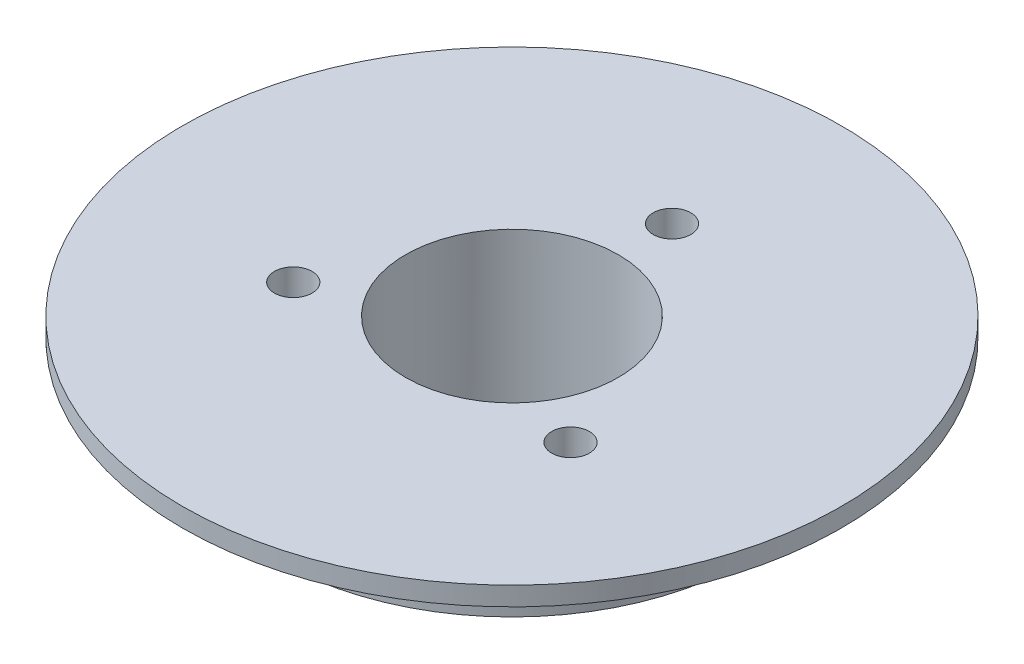
ISO-10303-21;
HEADER;
FILE_DESCRIPTION(('STEP AP214'),'2;1');
FILE_NAME('part.step','',(''),(''),'','','');
FILE_SCHEMA(('AUTOMOTIVE_DESIGN { 1 0 10303 214 1 1 1 1 }'));
ENDSEC;
DATA;
#1=APPLICATION_CONTEXT('core data for automotive mechanical design processes');
#2=APPLICATION_PROTOCOL_DEFINITION('international standard','automotive_design',2000,#1);
#3=PRODUCT_CONTEXT('',#1,'mechanical');
#4=PRODUCT('Part','Part','',(#3));
#5=PRODUCT_RELATED_PRODUCT_CATEGORY('part','',(#4));
#6=PRODUCT_DEFINITION_FORMATION('','',#4);
#7=PRODUCT_DEFINITION_CONTEXT('part definition',#1,'design');
#8=PRODUCT_DEFINITION('design','',#6,#7);
#9=PRODUCT_DEFINITION_SHAPE('','',#8);
#10=(LENGTH_UNIT() NAMED_UNIT(*) SI_UNIT(.MILLI.,.METRE.));
#11=(NAMED_UNIT(*) PLANE_ANGLE_UNIT() SI_UNIT($,.RADIAN.));
#12=(NAMED_UNIT(*) SI_UNIT($,.STERADIAN.) SOLID_ANGLE_UNIT());
#13=UNCERTAINTY_MEASURE_WITH_UNIT(LENGTH_MEASURE(1.E-05),#10,'distance_accuracy_value','');
#14=(GEOMETRIC_REPRESENTATION_CONTEXT(3) GLOBAL_UNCERTAINTY_ASSIGNED_CONTEXT((#13)) GLOBAL_UNIT_ASSIGNED_CONTEXT((#10,
#11,#12)) REPRESENTATION_CONTEXT('',''));
#15=CARTESIAN_POINT('',(0.,0.,0.));
#16=DIRECTION('',(0.,0.,1.));
#17=DIRECTION('',(1.,0.,0.));
#18=AXIS2_PLACEMENT_3D('',#15,#16,#17);
#19=CARTESIAN_POINT('',(0.,0.,0.));
#20=DIRECTION('',(0.,1.,0.));
#21=DIRECTION('',(0.,0.,1.));
#22=AXIS2_PLACEMENT_3D('',#19,#20,#21);
#23=PLANE('',#22);
#24=CARTESIAN_POINT('',(0.,0.,20.));
#25=DIRECTION('',(0.,-1.,0.));
#26=DIRECTION('',(0.,0.,-1.));
#27=AXIS2_PLACEMENT_3D('',#24,#25,#26);
#28=CIRCLE('',#27,2.);
#29=CARTESIAN_POINT('',(0.,0.,18.));
#30=VERTEX_POINT('',#29);
#31=EDGE_CURVE('E113',#30,#30,#28,.T.);
#32=ORIENTED_EDGE('',*,*,#31,.F.);
#33=EDGE_LOOP('',(#32));
#34=FACE_BOUND('',#33,.T.);
#35=CARTESIAN_POINT('',(17.3205080756901,0.,-9.99999999999926));
#36=DIRECTION('',(0.,-1.,0.));
#37=DIRECTION('',(0.,0.,-1.));
#38=AXIS2_PLACEMENT_3D('',#35,#36,#37);
#39=CIRCLE('',#38,2.0000000000011);
#40=CARTESIAN_POINT('',(17.3205080756901,0.,-12.0000000000004));
#41=VERTEX_POINT('',#40);
#42=EDGE_CURVE('E107',#41,#41,#39,.T.);
#43=ORIENTED_EDGE('',*,*,#42,.F.);
#44=EDGE_LOOP('',(#43));
#45=FACE_BOUND('',#44,.T.);
#46=CARTESIAN_POINT('',(-17.3205080756875,0.,-10.0000000000007));
#47=DIRECTION('',(0.,-1.,0.));
#48=DIRECTION('',(0.,0.,-1.));
#49=AXIS2_PLACEMENT_3D('',#46,#47,#48);
#50=CIRCLE('',#49,2.00000000000161);
#51=CARTESIAN_POINT('',(-17.3205080756875,0.,-12.0000000000024));
#52=VERTEX_POINT('',#51);
#53=EDGE_CURVE('E101',#52,#52,#50,.T.);
#54=ORIENTED_EDGE('',*,*,#53,.F.);
#55=EDGE_LOOP('',(#54));
#56=FACE_BOUND('',#55,.T.);
#57=CARTESIAN_POINT('',(0.,0.,0.));
#58=DIRECTION('',(0.,1.,0.));
#59=DIRECTION('',(0.,0.,1.));
#60=AXIS2_PLACEMENT_3D('',#57,#58,#59);
#61=CIRCLE('',#60,25.);
#62=CARTESIAN_POINT('',(0.,0.,25.));
#63=VERTEX_POINT('',#62);
#64=EDGE_CURVE('E89',#63,#63,#61,.T.);
#65=ORIENTED_EDGE('',*,*,#64,.F.);
#66=EDGE_LOOP('',(#65));
#67=FACE_BOUND('',#66,.T.);
#68=CARTESIAN_POINT('',(0.,0.,0.));
#69=DIRECTION('',(0.,1.,0.));
#70=DIRECTION('',(0.,0.,1.));
#71=AXIS2_PLACEMENT_3D('',#68,#69,#70);
#72=CIRCLE('',#71,12.5);
#73=CARTESIAN_POINT('',(0.,0.,12.5));
#74=VERTEX_POINT('',#73);
#75=EDGE_CURVE('E46',#74,#74,#72,.F.);
#76=ORIENTED_EDGE('',*,*,#75,.F.);
#77=EDGE_LOOP('',(#76));
#78=FACE_BOUND('',#77,.T.);
#79=ADVANCED_FACE('F35',(#34,#45,#56,#67,#78),#23,.F.);
#80=CARTESIAN_POINT('',(0.,10.,0.));
#81=DIRECTION('',(0.,1.,0.));
#82=DIRECTION('',(0.,0.,1.));
#83=AXIS2_PLACEMENT_3D('',#80,#81,#82);
#84=PLANE('',#83);
#85=CARTESIAN_POINT('',(-14.7224318643354,10.,8.50000000000007));
#86=DIRECTION('',(0.,1.,0.));
#87=DIRECTION('',(0.,0.,1.));
#88=AXIS2_PLACEMENT_3D('',#85,#86,#87);
#89=CIRCLE('',#88,2.);
#90=CARTESIAN_POINT('',(-14.7224318643354,10.,10.5000000000001));
#91=VERTEX_POINT('',#90);
#92=EDGE_CURVE('E64',#91,#91,#89,.F.);
#93=ORIENTED_EDGE('',*,*,#92,.T.);
#94=EDGE_LOOP('',(#93));
#95=FACE_BOUND('',#94,.T.);
#96=CARTESIAN_POINT('',(0.,10.,-17.));
#97=DIRECTION('',(0.,1.,0.));
#98=DIRECTION('',(0.,0.,1.));
#99=AXIS2_PLACEMENT_3D('',#96,#97,#98);
#100=CIRCLE('',#99,2.);
#101=CARTESIAN_POINT('',(0.,10.,-15.));
#102=VERTEX_POINT('',#101);
#103=EDGE_CURVE('E58',#102,#102,#100,.F.);
#104=ORIENTED_EDGE('',*,*,#103,.T.);
#105=EDGE_LOOP('',(#104));
#106=FACE_BOUND('',#105,.T.);
#107=CARTESIAN_POINT('',(14.7224318643354,10.,8.50000000000007));
#108=DIRECTION('',(0.,1.,0.));
#109=DIRECTION('',(0.,0.,1.));
#110=AXIS2_PLACEMENT_3D('',#107,#108,#109);
#111=CIRCLE('',#110,2.);
#112=CARTESIAN_POINT('',(14.7224318643354,10.,10.5000000000001));
#113=VERTEX_POINT('',#112);
#114=EDGE_CURVE('E61',#113,#113,#111,.F.);
#115=ORIENTED_EDGE('',*,*,#114,.T.);
#116=EDGE_LOOP('',(#115));
#117=FACE_BOUND('',#116,.T.);
#118=CARTESIAN_POINT('',(0.,10.,0.));
#119=DIRECTION('',(0.,1.,0.));
#120=DIRECTION('',(0.,0.,1.));
#121=AXIS2_PLACEMENT_3D('',#118,#119,#120);
#122=CIRCLE('',#121,11.3);
#123=CARTESIAN_POINT('',(0.,10.,11.3));
#124=VERTEX_POINT('',#123);
#125=EDGE_CURVE('E67',#124,#124,#122,.T.);
#126=ORIENTED_EDGE('',*,*,#125,.F.);
#127=EDGE_LOOP('',(#126));
#128=FACE_BOUND('',#127,.T.);
#129=CARTESIAN_POINT('',(0.,10.,0.));
#130=DIRECTION('',(0.,1.,0.));
#131=DIRECTION('',(0.,0.,1.));
#132=AXIS2_PLACEMENT_3D('',#129,#130,#131);
#133=CIRCLE('',#132,35.);
#134=CARTESIAN_POINT('',(0.,10.,35.));
#135=VERTEX_POINT('',#134);
#136=EDGE_CURVE('E86',#135,#135,#133,.T.);
#137=ORIENTED_EDGE('',*,*,#136,.T.);
#138=EDGE_LOOP('',(#137));
#139=FACE_BOUND('',#138,.T.);
#140=ADVANCED_FACE('F130',(#95,#106,#117,#128,#139),#84,.T.);
#141=CARTESIAN_POINT('',(0.,2.,-17.));
#142=DIRECTION('',(0.,1.,0.));
#143=DIRECTION('',(0.,0.,1.));
#144=AXIS2_PLACEMENT_3D('',#141,#142,#143);
#145=PLANE('',#144);
#146=CARTESIAN_POINT('',(0.,2.,-17.));
#147=DIRECTION('',(0.,1.,0.));
#148=DIRECTION('',(0.,0.,1.));
#149=AXIS2_PLACEMENT_3D('',#146,#147,#148);
#150=CIRCLE('',#149,2.);
#151=CARTESIAN_POINT('',(0.,2.,-15.));
#152=VERTEX_POINT('',#151);
#153=EDGE_CURVE('E71',#152,#152,#150,.T.);
#154=ORIENTED_EDGE('',*,*,#153,.T.);
#155=EDGE_LOOP('',(#154));
#156=FACE_BOUND('',#155,.T.);
#157=ADVANCED_FACE('F132',(#156),#145,.T.);
#158=CARTESIAN_POINT('',(0.,2.,-17.));
#159=DIRECTION('',(0.,1.,0.));
#160=DIRECTION('',(0.,0.,1.));
#161=AXIS2_PLACEMENT_3D('',#158,#159,#160);
#162=CYLINDRICAL_SURFACE('',#161,2.);
#163=ORIENTED_EDGE('',*,*,#153,.F.);
#164=EDGE_LOOP('',(#163));
#165=FACE_BOUND('',#164,.T.);
#166=ORIENTED_EDGE('',*,*,#103,.F.);
#167=EDGE_LOOP('',(#166));
#168=FACE_BOUND('',#167,.T.);
#169=ADVANCED_FACE('F189',(#165,#168),#162,.F.);
#170=CARTESIAN_POINT('',(14.7224318643354,2.,8.50000000000007));
#171=DIRECTION('',(0.,1.,0.));
#172=DIRECTION('',(0.,0.,1.));
#173=AXIS2_PLACEMENT_3D('',#170,#171,#172);
#174=PLANE('',#173);
#175=CARTESIAN_POINT('',(14.7224318643354,2.,8.50000000000007));
#176=DIRECTION('',(0.,1.,0.));
#177=DIRECTION('',(0.,0.,1.));
#178=AXIS2_PLACEMENT_3D('',#175,#176,#177);
#179=CIRCLE('',#178,2.);
#180=CARTESIAN_POINT('',(14.7224318643354,2.,10.5000000000001));
#181=VERTEX_POINT('',#180);
#182=EDGE_CURVE('E74',#181,#181,#179,.T.);
#183=ORIENTED_EDGE('',*,*,#182,.T.);
#184=EDGE_LOOP('',(#183));
#185=FACE_BOUND('',#184,.T.);
#186=ADVANCED_FACE('F186',(#185),#174,.T.);
#187=CARTESIAN_POINT('',(14.7224318643354,2.,8.50000000000007));
#188=DIRECTION('',(0.,1.,0.));
#189=DIRECTION('',(0.,0.,1.));
#190=AXIS2_PLACEMENT_3D('',#187,#188,#189);
#191=CYLINDRICAL_SURFACE('',#190,2.);
#192=ORIENTED_EDGE('',*,*,#182,.F.);
#193=EDGE_LOOP('',(#192));
#194=FACE_BOUND('',#193,.T.);
#195=ORIENTED_EDGE('',*,*,#114,.F.);
#196=EDGE_LOOP('',(#195));
#197=FACE_BOUND('',#196,.T.);
#198=ADVANCED_FACE('F184',(#194,#197),#191,.F.);
#199=CARTESIAN_POINT('',(-14.7224318643354,2.,8.50000000000007));
#200=DIRECTION('',(0.,-1.,0.));
#201=DIRECTION('',(0.,0.,-1.));
#202=AXIS2_PLACEMENT_3D('',#199,#200,#201);
#203=PLANE('',#202);
#204=CARTESIAN_POINT('',(-14.7224318643354,2.,8.50000000000007));
#205=DIRECTION('',(0.,1.,0.));
#206=DIRECTION('',(0.,0.,-1.));
#207=AXIS2_PLACEMENT_3D('',#204,#205,#206);
#208=CIRCLE('',#207,2.);
#209=CARTESIAN_POINT('',(-14.7224318643354,2.,6.50000000000007));
#210=VERTEX_POINT('',#209);
#211=EDGE_CURVE('E50',#210,#210,#208,.T.);
#212=ORIENTED_EDGE('',*,*,#211,.T.);
#213=EDGE_LOOP('',(#212));
#214=FACE_BOUND('',#213,.T.);
#215=ADVANCED_FACE('F180',(#214),#203,.F.);
#216=CARTESIAN_POINT('',(-14.7224318643354,2.,8.50000000000007));
#217=DIRECTION('',(0.,1.,0.));
#218=DIRECTION('',(0.,0.,1.));
#219=AXIS2_PLACEMENT_3D('',#216,#217,#218);
#220=CYLINDRICAL_SURFACE('',#219,2.);
#221=ORIENTED_EDGE('',*,*,#211,.F.);
#222=EDGE_LOOP('',(#221));
#223=FACE_BOUND('',#222,.T.);
#224=ORIENTED_EDGE('',*,*,#92,.F.);
#225=EDGE_LOOP('',(#224));
#226=FACE_BOUND('',#225,.T.);
#227=ADVANCED_FACE('F183',(#223,#226),#220,.F.);
#228=CARTESIAN_POINT('',(0.,8.,0.));
#229=DIRECTION('',(0.,-1.,0.));
#230=DIRECTION('',(0.,0.,-1.));
#231=AXIS2_PLACEMENT_3D('',#228,#229,#230);
#232=CYLINDRICAL_SURFACE('',#231,11.3);
#233=ORIENTED_EDGE('',*,*,#125,.T.);
#234=EDGE_LOOP('',(#233));
#235=FACE_BOUND('',#234,.T.);
#236=CARTESIAN_POINT('',(0.,-7.,0.));
#237=DIRECTION('',(0.,-1.,0.));
#238=DIRECTION('',(0.,0.,-1.));
#239=AXIS2_PLACEMENT_3D('',#236,#237,#238);
#240=CIRCLE('',#239,11.3);
#241=CARTESIAN_POINT('',(0.,-7.,-11.3));
#242=VERTEX_POINT('',#241);
#243=EDGE_CURVE('E56',#242,#242,#240,.F.);
#244=ORIENTED_EDGE('',*,*,#243,.F.);
#245=EDGE_LOOP('',(#244));
#246=FACE_BOUND('',#245,.T.);
#247=ADVANCED_FACE('F178',(#235,#246),#232,.F.);
#248=CARTESIAN_POINT('',(0.,45.,0.));
#249=DIRECTION('',(0.,-1.,0.));
#250=DIRECTION('',(0.,0.,-1.));
#251=AXIS2_PLACEMENT_3D('',#248,#249,#250);
#252=CYLINDRICAL_SURFACE('',#251,7.5);
#253=CARTESIAN_POINT('',(0.,-7.,0.));
#254=DIRECTION('',(0.,-1.,0.));
#255=DIRECTION('',(0.,0.,-1.));
#256=AXIS2_PLACEMENT_3D('',#253,#254,#255);
#257=CIRCLE('',#256,7.5);
#258=CARTESIAN_POINT('',(0.,-7.,-7.5));
#259=VERTEX_POINT('',#258);
#260=EDGE_CURVE('E53',#259,#259,#257,.F.);
#261=ORIENTED_EDGE('',*,*,#260,.T.);
#262=EDGE_LOOP('',(#261));
#263=FACE_BOUND('',#262,.T.);
#264=CARTESIAN_POINT('',(0.,-9.,0.));
#265=DIRECTION('',(0.,-1.,0.));
#266=DIRECTION('',(0.,0.,-1.));
#267=AXIS2_PLACEMENT_3D('',#264,#265,#266);
#268=CIRCLE('',#267,7.5);
#269=CARTESIAN_POINT('',(0.,-9.,-7.5));
#270=VERTEX_POINT('',#269);
#271=EDGE_CURVE('E55',#270,#270,#268,.T.);
#272=ORIENTED_EDGE('',*,*,#271,.T.);
#273=EDGE_LOOP('',(#272));
#274=FACE_BOUND('',#273,.T.);
#275=ADVANCED_FACE('F159',(#263,#274),#252,.F.);
#276=CARTESIAN_POINT('',(0.,8.,0.));
#277=DIRECTION('',(0.,-1.,0.));
#278=DIRECTION('',(0.,0.,-1.));
#279=AXIS2_PLACEMENT_3D('',#276,#277,#278);
#280=CYLINDRICAL_SURFACE('',#279,25.);
#281=CARTESIAN_POINT('',(0.,7.,0.));
#282=DIRECTION('',(0.,-1.,0.));
#283=DIRECTION('',(0.,0.,-1.));
#284=AXIS2_PLACEMENT_3D('',#281,#282,#283);
#285=CIRCLE('',#284,25.);
#286=CARTESIAN_POINT('',(0.,7.,-25.));
#287=VERTEX_POINT('',#286);
#288=EDGE_CURVE('E82',#287,#287,#285,.T.);
#289=ORIENTED_EDGE('',*,*,#288,.T.);
#290=EDGE_LOOP('',(#289));
#291=FACE_BOUND('',#290,.T.);
#292=ORIENTED_EDGE('',*,*,#64,.T.);
#293=EDGE_LOOP('',(#292));
#294=FACE_BOUND('',#293,.T.);
#295=ADVANCED_FACE('F156',(#291,#294),#280,.T.);
#296=CARTESIAN_POINT('',(0.,8.,0.));
#297=DIRECTION('',(0.,1.,0.));
#298=DIRECTION('',(0.,0.,1.));
#299=AXIS2_PLACEMENT_3D('',#296,#297,#298);
#300=PLANE('',#299);
#301=CARTESIAN_POINT('',(0.,8.,0.));
#302=DIRECTION('',(0.,1.,0.));
#303=DIRECTION('',(0.,0.,1.));
#304=AXIS2_PLACEMENT_3D('',#301,#302,#303);
#305=CIRCLE('',#304,27.5);
#306=CARTESIAN_POINT('',(0.,8.,27.5));
#307=VERTEX_POINT('',#306);
#308=EDGE_CURVE('E70',#307,#307,#305,.F.);
#309=ORIENTED_EDGE('',*,*,#308,.F.);
#310=EDGE_LOOP('',(#309));
#311=FACE_BOUND('',#310,.T.);
#312=CARTESIAN_POINT('',(0.,8.,0.));
#313=DIRECTION('',(0.,1.,0.));
#314=DIRECTION('',(0.,0.,1.));
#315=AXIS2_PLACEMENT_3D('',#312,#313,#314);
#316=CIRCLE('',#315,35.);
#317=CARTESIAN_POINT('',(0.,8.,35.));
#318=VERTEX_POINT('',#317);
#319=EDGE_CURVE('E85',#318,#318,#316,.T.);
#320=ORIENTED_EDGE('',*,*,#319,.F.);
#321=EDGE_LOOP('',(#320));
#322=FACE_BOUND('',#321,.T.);
#323=ADVANCED_FACE('F158',(#311,#322),#300,.F.);
#324=CARTESIAN_POINT('',(0.,10.,0.));
#325=DIRECTION('',(0.,-1.,0.));
#326=DIRECTION('',(0.,0.,-1.));
#327=AXIS2_PLACEMENT_3D('',#324,#325,#326);
#328=CYLINDRICAL_SURFACE('',#327,35.);
#329=ORIENTED_EDGE('',*,*,#136,.F.);
#330=EDGE_LOOP('',(#329));
#331=FACE_BOUND('',#330,.T.);
#332=ORIENTED_EDGE('',*,*,#319,.T.);
#333=EDGE_LOOP('',(#332));
#334=FACE_BOUND('',#333,.T.);
#335=ADVANCED_FACE('F162',(#331,#334),#328,.T.);
#336=CARTESIAN_POINT('',(0.,7.,0.));
#337=DIRECTION('',(0.,-1.,0.));
#338=DIRECTION('',(0.,0.,-1.));
#339=AXIS2_PLACEMENT_3D('',#336,#337,#338);
#340=PLANE('',#339);
#341=CARTESIAN_POINT('',(0.,7.,0.));
#342=DIRECTION('',(0.,-1.,0.));
#343=DIRECTION('',(0.,0.,-1.));
#344=AXIS2_PLACEMENT_3D('',#341,#342,#343);
#345=CIRCLE('',#344,27.5);
#346=CARTESIAN_POINT('',(0.,7.,-27.5));
#347=VERTEX_POINT('',#346);
#348=EDGE_CURVE('E75',#347,#347,#345,.T.);
#349=ORIENTED_EDGE('',*,*,#348,.T.);
#350=EDGE_LOOP('',(#349));
#351=FACE_BOUND('',#350,.T.);
#352=ORIENTED_EDGE('',*,*,#288,.F.);
#353=EDGE_LOOP('',(#352));
#354=FACE_BOUND('',#353,.T.);
#355=ADVANCED_FACE('F165',(#351,#354),#340,.T.);
#356=CARTESIAN_POINT('',(0.,7.,0.));
#357=DIRECTION('',(0.,1.,0.));
#358=DIRECTION('',(0.,0.,1.));
#359=AXIS2_PLACEMENT_3D('',#356,#357,#358);
#360=CYLINDRICAL_SURFACE('',#359,27.5);
#361=ORIENTED_EDGE('',*,*,#348,.F.);
#362=EDGE_LOOP('',(#361));
#363=FACE_BOUND('',#362,.T.);
#364=ORIENTED_EDGE('',*,*,#308,.T.);
#365=EDGE_LOOP('',(#364));
#366=FACE_BOUND('',#365,.T.);
#367=ADVANCED_FACE('F153',(#363,#366),#360,.T.);
#368=CARTESIAN_POINT('',(0.,-9.,0.));
#369=DIRECTION('',(0.,-1.,0.));
#370=DIRECTION('',(0.,0.,-1.));
#371=AXIS2_PLACEMENT_3D('',#368,#369,#370);
#372=PLANE('',#371);
#373=CARTESIAN_POINT('',(0.,-9.,0.));
#374=DIRECTION('',(0.,-1.,0.));
#375=DIRECTION('',(0.,0.,-1.));
#376=AXIS2_PLACEMENT_3D('',#373,#374,#375);
#377=CIRCLE('',#376,10.5);
#378=CARTESIAN_POINT('',(0.,-9.,-10.5));
#379=VERTEX_POINT('',#378);
#380=EDGE_CURVE('E42',#379,#379,#377,.T.);
#381=ORIENTED_EDGE('',*,*,#380,.T.);
#382=EDGE_LOOP('',(#381));
#383=FACE_BOUND('',#382,.T.);
#384=ORIENTED_EDGE('',*,*,#271,.F.);
#385=EDGE_LOOP('',(#384));
#386=FACE_BOUND('',#385,.T.);
#387=ADVANCED_FACE('F144',(#383,#386),#372,.T.);
#388=CARTESIAN_POINT('',(0.,-9.,0.));
#389=DIRECTION('',(0.,1.,0.));
#390=DIRECTION('',(0.,0.,1.));
#391=AXIS2_PLACEMENT_3D('',#388,#389,#390);
#392=CYLINDRICAL_SURFACE('',#391,12.5);
#393=CARTESIAN_POINT('',(0.,-6.99999999999999,0.));
#394=DIRECTION('',(0.,-1.,0.));
#395=DIRECTION('',(0.,0.,-1.));
#396=AXIS2_PLACEMENT_3D('',#393,#394,#395);
#397=CIRCLE('',#396,12.5);
#398=CARTESIAN_POINT('',(0.,-6.99999999999999,-12.5));
#399=VERTEX_POINT('',#398);
#400=EDGE_CURVE('E11',#399,#399,#397,.F.);
#401=ORIENTED_EDGE('',*,*,#400,.T.);
#402=EDGE_LOOP('',(#401));
#403=FACE_BOUND('',#402,.T.);
#404=ORIENTED_EDGE('',*,*,#75,.T.);
#405=EDGE_LOOP('',(#404));
#406=FACE_BOUND('',#405,.T.);
#407=ADVANCED_FACE('F141',(#403,#406),#392,.T.);
#408=CARTESIAN_POINT('',(0.,-7.,0.));
#409=DIRECTION('',(0.,-1.,0.));
#410=DIRECTION('',(0.,0.,-1.));
#411=AXIS2_PLACEMENT_3D('',#408,#409,#410);
#412=PLANE('',#411);
#413=ORIENTED_EDGE('',*,*,#243,.T.);
#414=EDGE_LOOP('',(#413));
#415=FACE_BOUND('',#414,.T.);
#416=ORIENTED_EDGE('',*,*,#260,.F.);
#417=EDGE_LOOP('',(#416));
#418=FACE_BOUND('',#417,.T.);
#419=ADVANCED_FACE('F143',(#415,#418),#412,.F.);
#420=CARTESIAN_POINT('',(-17.3205080756875,8.,-10.0000000000007));
#421=DIRECTION('',(0.,-1.,0.));
#422=DIRECTION('',(0.,0.,-1.));
#423=AXIS2_PLACEMENT_3D('',#420,#421,#422);
#424=CYLINDRICAL_SURFACE('',#423,2.00000000000161);
#425=CARTESIAN_POINT('',(-17.3205080756875,8.,-10.0000000000007));
#426=DIRECTION('',(0.,-1.,0.));
#427=DIRECTION('',(0.,0.,-1.));
#428=AXIS2_PLACEMENT_3D('',#425,#426,#427);
#429=CIRCLE('',#428,2.00000000000161);
#430=CARTESIAN_POINT('',(-17.3205080756875,8.,-12.0000000000024));
#431=VERTEX_POINT('',#430);
#432=EDGE_CURVE('E104',#431,#431,#429,.T.);
#433=ORIENTED_EDGE('',*,*,#432,.F.);
#434=EDGE_LOOP('',(#433));
#435=FACE_BOUND('',#434,.T.);
#436=ORIENTED_EDGE('',*,*,#53,.T.);
#437=EDGE_LOOP('',(#436));
#438=FACE_BOUND('',#437,.T.);
#439=ADVANCED_FACE('F150',(#435,#438),#424,.F.);
#440=CARTESIAN_POINT('',(-17.3205080756875,8.,-10.0000000000007));
#441=DIRECTION('',(0.,-1.,0.));
#442=DIRECTION('',(0.,0.,-1.));
#443=AXIS2_PLACEMENT_3D('',#440,#441,#442);
#444=PLANE('',#443);
#445=ORIENTED_EDGE('',*,*,#432,.T.);
#446=EDGE_LOOP('',(#445));
#447=FACE_BOUND('',#446,.T.);
#448=ADVANCED_FACE('F281',(#447),#444,.T.);
#449=CARTESIAN_POINT('',(17.3205080756901,8.,-9.99999999999926));
#450=DIRECTION('',(0.,-1.,0.));
#451=DIRECTION('',(0.,0.,-1.));
#452=AXIS2_PLACEMENT_3D('',#449,#450,#451);
#453=CYLINDRICAL_SURFACE('',#452,2.0000000000011);
#454=CARTESIAN_POINT('',(17.3205080756901,8.,-9.99999999999926));
#455=DIRECTION('',(0.,-1.,0.));
#456=DIRECTION('',(0.,0.,-1.));
#457=AXIS2_PLACEMENT_3D('',#454,#455,#456);
#458=CIRCLE('',#457,2.0000000000011);
#459=CARTESIAN_POINT('',(17.3205080756901,8.,-12.0000000000004));
#460=VERTEX_POINT('',#459);
#461=EDGE_CURVE('E110',#460,#460,#458,.T.);
#462=ORIENTED_EDGE('',*,*,#461,.F.);
#463=EDGE_LOOP('',(#462));
#464=FACE_BOUND('',#463,.T.);
#465=ORIENTED_EDGE('',*,*,#42,.T.);
#466=EDGE_LOOP('',(#465));
#467=FACE_BOUND('',#466,.T.);
#468=ADVANCED_FACE('F291',(#464,#467),#453,.F.);
#469=CARTESIAN_POINT('',(17.3205080756901,8.,-9.99999999999926));
#470=DIRECTION('',(0.,-1.,0.));
#471=DIRECTION('',(0.,0.,-1.));
#472=AXIS2_PLACEMENT_3D('',#469,#470,#471);
#473=PLANE('',#472);
#474=ORIENTED_EDGE('',*,*,#461,.T.);
#475=EDGE_LOOP('',(#474));
#476=FACE_BOUND('',#475,.T.);
#477=ADVANCED_FACE('F124',(#476),#473,.T.);
#478=CARTESIAN_POINT('',(0.,8.,20.));
#479=DIRECTION('',(0.,-1.,0.));
#480=DIRECTION('',(0.,0.,-1.));
#481=AXIS2_PLACEMENT_3D('',#478,#479,#480);
#482=CYLINDRICAL_SURFACE('',#481,2.);
#483=CARTESIAN_POINT('',(0.,8.,20.));
#484=DIRECTION('',(0.,-1.,0.));
#485=DIRECTION('',(0.,0.,-1.));
#486=AXIS2_PLACEMENT_3D('',#483,#484,#485);
#487=CIRCLE('',#486,2.);
#488=CARTESIAN_POINT('',(0.,8.,18.));
#489=VERTEX_POINT('',#488);
#490=EDGE_CURVE('E100',#489,#489,#487,.T.);
#491=ORIENTED_EDGE('',*,*,#490,.F.);
#492=EDGE_LOOP('',(#491));
#493=FACE_BOUND('',#492,.T.);
#494=ORIENTED_EDGE('',*,*,#31,.T.);
#495=EDGE_LOOP('',(#494));
#496=FACE_BOUND('',#495,.T.);
#497=ADVANCED_FACE('F121',(#493,#496),#482,.F.);
#498=CARTESIAN_POINT('',(0.,8.,20.));
#499=DIRECTION('',(0.,-1.,0.));
#500=DIRECTION('',(0.,0.,-1.));
#501=AXIS2_PLACEMENT_3D('',#498,#499,#500);
#502=PLANE('',#501);
#503=ORIENTED_EDGE('',*,*,#490,.T.);
#504=EDGE_LOOP('',(#503));
#505=FACE_BOUND('',#504,.T.);
#506=ADVANCED_FACE('F119',(#505),#502,.T.);
#507=CARTESIAN_POINT('',(0.,-9.,0.));
#508=DIRECTION('',(0.,1.,0.));
#509=DIRECTION('',(0.,0.,1.));
#510=AXIS2_PLACEMENT_3D('',#507,#508,#509);
#511=CONICAL_SURFACE('',#510,10.5,0.785398163397448);
#512=ORIENTED_EDGE('',*,*,#400,.F.);
#513=EDGE_LOOP('',(#512));
#514=FACE_BOUND('',#513,.T.);
#515=ORIENTED_EDGE('',*,*,#380,.F.);
#516=EDGE_LOOP('',(#515));
#517=FACE_BOUND('',#516,.T.);
#518=ADVANCED_FACE('F37',(#514,#517),#511,.T.);
#519=CLOSED_SHELL('',(#79,#140,#157,#169,#186,#198,#215,#227,#247,#275,#295,#323,#335,#355,#367,
#387,#407,#419,#439,#448,#468,#477,#497,#506,#518));
#520=MANIFOLD_SOLID_BREP('B2',#519);
#521=ADVANCED_BREP_SHAPE_REPRESENTATION('',(#18,#520),#14);
#522=SHAPE_DEFINITION_REPRESENTATION(#9,#521);
ENDSEC;
END-ISO-10303-21;
